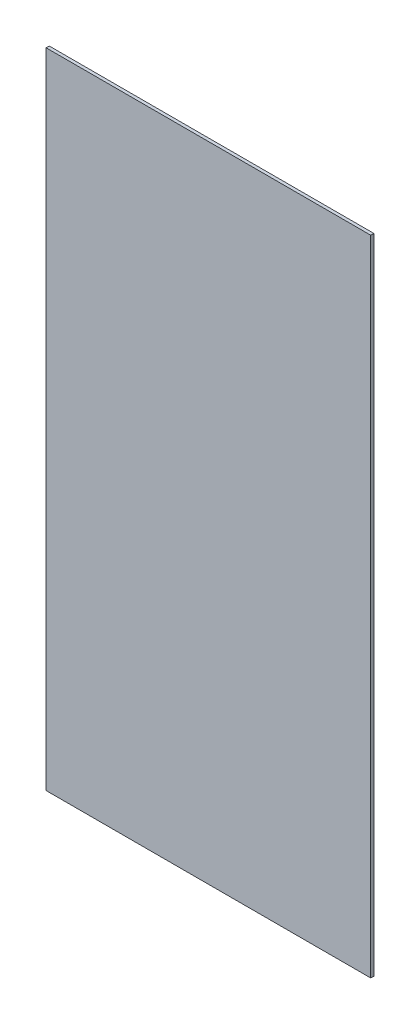
ISO-10303-21;
HEADER;
FILE_DESCRIPTION(('STEP AP214'),'2;1');
FILE_NAME('part.step','',(''),(''),'','','');
FILE_SCHEMA(('AUTOMOTIVE_DESIGN { 1 0 10303 214 1 1 1 1 }'));
ENDSEC;
DATA;
#1=APPLICATION_CONTEXT('core data for automotive mechanical design processes');
#2=APPLICATION_PROTOCOL_DEFINITION('international standard','automotive_design',2000,#1);
#3=PRODUCT_CONTEXT('',#1,'mechanical');
#4=PRODUCT('Part','Part','',(#3));
#5=PRODUCT_RELATED_PRODUCT_CATEGORY('part','',(#4));
#6=PRODUCT_DEFINITION_FORMATION('','',#4);
#7=PRODUCT_DEFINITION_CONTEXT('part definition',#1,'design');
#8=PRODUCT_DEFINITION('design','',#6,#7);
#9=PRODUCT_DEFINITION_SHAPE('','',#8);
#10=(LENGTH_UNIT() NAMED_UNIT(*) SI_UNIT(.MILLI.,.METRE.));
#11=(NAMED_UNIT(*) PLANE_ANGLE_UNIT() SI_UNIT($,.RADIAN.));
#12=(NAMED_UNIT(*) SI_UNIT($,.STERADIAN.) SOLID_ANGLE_UNIT());
#13=UNCERTAINTY_MEASURE_WITH_UNIT(LENGTH_MEASURE(1.E-05),#10,'distance_accuracy_value','');
#14=(GEOMETRIC_REPRESENTATION_CONTEXT(3) GLOBAL_UNCERTAINTY_ASSIGNED_CONTEXT((#13)) GLOBAL_UNIT_ASSIGNED_CONTEXT((#10,
#11,#12)) REPRESENTATION_CONTEXT('',''));
#15=CARTESIAN_POINT('',(0.,0.,0.));
#16=DIRECTION('',(0.,0.,1.));
#17=DIRECTION('',(1.,0.,0.));
#18=AXIS2_PLACEMENT_3D('',#15,#16,#17);
#19=CARTESIAN_POINT('',(-408.027306533152,376.861510791367,5.));
#20=DIRECTION('',(1.,0.,0.));
#21=DIRECTION('',(0.,0.,-1.));
#22=AXIS2_PLACEMENT_3D('',#19,#20,#21);
#23=PLANE('',#22);
#24=DIRECTION('',(0.,-1.,0.));
#25=VECTOR('',#24,1.);
#26=CARTESIAN_POINT('',(-408.027306533152,376.861510791367,0.));
#27=LINE('',#26,#25);
#28=CARTESIAN_POINT('',(-408.027306533152,376.861510791367,0.));
#29=VERTEX_POINT('',#28);
#30=CARTESIAN_POINT('',(-408.027306533152,-653.638489208633,0.));
#31=VERTEX_POINT('',#30);
#32=EDGE_CURVE('E107',#29,#31,#27,.T.);
#33=ORIENTED_EDGE('',*,*,#32,.T.);
#34=DIRECTION('',(0.,0.,-1.));
#35=VECTOR('',#34,1.);
#36=CARTESIAN_POINT('',(-408.027306533152,-653.638489208633,5.));
#37=LINE('',#36,#35);
#38=CARTESIAN_POINT('',(-408.027306533152,-653.638489208633,5.));
#39=VERTEX_POINT('',#38);
#40=EDGE_CURVE('E11',#39,#31,#37,.T.);
#41=ORIENTED_EDGE('',*,*,#40,.F.);
#42=DIRECTION('',(0.,-1.,0.));
#43=VECTOR('',#42,1.);
#44=CARTESIAN_POINT('',(-408.027306533152,376.861510791367,5.));
#45=LINE('',#44,#43);
#46=CARTESIAN_POINT('',(-408.027306533152,376.861510791367,5.));
#47=VERTEX_POINT('',#46);
#48=EDGE_CURVE('E91',#47,#39,#45,.T.);
#49=ORIENTED_EDGE('',*,*,#48,.F.);
#50=DIRECTION('',(0.,0.,-1.));
#51=VECTOR('',#50,1.);
#52=CARTESIAN_POINT('',(-408.027306533152,376.861510791367,5.));
#53=LINE('',#52,#51);
#54=EDGE_CURVE('E103',#47,#29,#53,.T.);
#55=ORIENTED_EDGE('',*,*,#54,.T.);
#56=EDGE_LOOP('',(#33,#41,#49,#55));
#57=FACE_BOUND('',#56,.T.);
#58=ADVANCED_FACE('F39',(#57),#23,.F.);
#59=CARTESIAN_POINT('',(-408.027306533152,-653.638489208633,5.));
#60=DIRECTION('',(0.,1.,0.));
#61=DIRECTION('',(-1.,0.,0.));
#62=AXIS2_PLACEMENT_3D('',#59,#60,#61);
#63=PLANE('',#62);
#64=DIRECTION('',(1.,0.,0.));
#65=VECTOR('',#64,1.);
#66=CARTESIAN_POINT('',(-408.027306533152,-653.638489208633,0.));
#67=LINE('',#66,#65);
#68=CARTESIAN_POINT('',(111.972693466848,-653.638489208633,0.));
#69=VERTEX_POINT('',#68);
#70=EDGE_CURVE('E96',#31,#69,#67,.T.);
#71=ORIENTED_EDGE('',*,*,#70,.T.);
#72=DIRECTION('',(0.,0.,-1.));
#73=VECTOR('',#72,1.);
#74=CARTESIAN_POINT('',(111.972693466848,-653.638489208633,5.));
#75=LINE('',#74,#73);
#76=CARTESIAN_POINT('',(111.972693466848,-653.638489208633,5.));
#77=VERTEX_POINT('',#76);
#78=EDGE_CURVE('E48',#77,#69,#75,.T.);
#79=ORIENTED_EDGE('',*,*,#78,.F.);
#80=DIRECTION('',(1.,0.,0.));
#81=VECTOR('',#80,1.);
#82=CARTESIAN_POINT('',(-408.027306533152,-653.638489208633,5.));
#83=LINE('',#82,#81);
#84=EDGE_CURVE('E86',#39,#77,#83,.T.);
#85=ORIENTED_EDGE('',*,*,#84,.F.);
#86=ORIENTED_EDGE('',*,*,#40,.T.);
#87=EDGE_LOOP('',(#71,#79,#85,#86));
#88=FACE_BOUND('',#87,.T.);
#89=ADVANCED_FACE('F95',(#88),#63,.F.);
#90=CARTESIAN_POINT('',(111.972693466848,376.861510791367,5.));
#91=DIRECTION('',(-1.,0.,0.));
#92=DIRECTION('',(0.,-1.,0.));
#93=AXIS2_PLACEMENT_3D('',#90,#91,#92);
#94=PLANE('',#93);
#95=DIRECTION('',(0.,1.,0.));
#96=VECTOR('',#95,1.);
#97=CARTESIAN_POINT('',(111.972693466848,376.861510791367,0.));
#98=LINE('',#97,#96);
#99=CARTESIAN_POINT('',(111.972693466848,376.861510791367,0.));
#100=VERTEX_POINT('',#99);
#101=EDGE_CURVE('E73',#69,#100,#98,.T.);
#102=ORIENTED_EDGE('',*,*,#101,.T.);
#103=DIRECTION('',(0.,0.,-1.));
#104=VECTOR('',#103,1.);
#105=CARTESIAN_POINT('',(111.972693466848,376.861510791367,5.));
#106=LINE('',#105,#104);
#107=CARTESIAN_POINT('',(111.972693466848,376.861510791367,5.));
#108=VERTEX_POINT('',#107);
#109=EDGE_CURVE('E98',#108,#100,#106,.T.);
#110=ORIENTED_EDGE('',*,*,#109,.F.);
#111=DIRECTION('',(0.,1.,0.));
#112=VECTOR('',#111,1.);
#113=CARTESIAN_POINT('',(111.972693466848,376.861510791367,5.));
#114=LINE('',#113,#112);
#115=EDGE_CURVE('E89',#77,#108,#114,.T.);
#116=ORIENTED_EDGE('',*,*,#115,.F.);
#117=ORIENTED_EDGE('',*,*,#78,.T.);
#118=EDGE_LOOP('',(#102,#110,#116,#117));
#119=FACE_BOUND('',#118,.T.);
#120=ADVANCED_FACE('F99',(#119),#94,.F.);
#121=CARTESIAN_POINT('',(-408.027306533152,376.861510791367,5.));
#122=DIRECTION('',(0.,-1.,0.));
#123=DIRECTION('',(0.,0.,-1.));
#124=AXIS2_PLACEMENT_3D('',#121,#122,#123);
#125=PLANE('',#124);
#126=DIRECTION('',(-1.,0.,0.));
#127=VECTOR('',#126,1.);
#128=CARTESIAN_POINT('',(-408.027306533152,376.861510791367,0.));
#129=LINE('',#128,#127);
#130=EDGE_CURVE('E79',#100,#29,#129,.T.);
#131=ORIENTED_EDGE('',*,*,#130,.T.);
#132=ORIENTED_EDGE('',*,*,#54,.F.);
#133=DIRECTION('',(-1.,0.,0.));
#134=VECTOR('',#133,1.);
#135=CARTESIAN_POINT('',(-408.027306533152,376.861510791367,5.));
#136=LINE('',#135,#134);
#137=EDGE_CURVE('E56',#108,#47,#136,.T.);
#138=ORIENTED_EDGE('',*,*,#137,.F.);
#139=ORIENTED_EDGE('',*,*,#109,.T.);
#140=EDGE_LOOP('',(#131,#132,#138,#139));
#141=FACE_BOUND('',#140,.T.);
#142=ADVANCED_FACE('F120',(#141),#125,.F.);
#143=CARTESIAN_POINT('',(0.,0.,5.));
#144=DIRECTION('',(0.,0.,1.));
#145=DIRECTION('',(1.,0.,0.));
#146=AXIS2_PLACEMENT_3D('',#143,#144,#145);
#147=PLANE('',#146);
#148=ORIENTED_EDGE('',*,*,#48,.T.);
#149=ORIENTED_EDGE('',*,*,#84,.T.);
#150=ORIENTED_EDGE('',*,*,#115,.T.);
#151=ORIENTED_EDGE('',*,*,#137,.T.);
#152=EDGE_LOOP('',(#148,#149,#150,#151));
#153=FACE_BOUND('',#152,.T.);
#154=ADVANCED_FACE('F87',(#153),#147,.T.);
#155=CARTESIAN_POINT('',(0.,0.,0.));
#156=DIRECTION('',(0.,0.,1.));
#157=DIRECTION('',(1.,0.,0.));
#158=AXIS2_PLACEMENT_3D('',#155,#156,#157);
#159=PLANE('',#158);
#160=ORIENTED_EDGE('',*,*,#32,.F.);
#161=ORIENTED_EDGE('',*,*,#130,.F.);
#162=ORIENTED_EDGE('',*,*,#101,.F.);
#163=ORIENTED_EDGE('',*,*,#70,.F.);
#164=EDGE_LOOP('',(#160,#161,#162,#163));
#165=FACE_BOUND('',#164,.T.);
#166=ADVANCED_FACE('F123',(#165),#159,.F.);
#167=CLOSED_SHELL('',(#58,#89,#120,#142,#154,#166));
#168=MANIFOLD_SOLID_BREP('B2',#167);
#169=ADVANCED_BREP_SHAPE_REPRESENTATION('',(#18,#168),#14);
#170=SHAPE_DEFINITION_REPRESENTATION(#9,#169);
ENDSEC;
END-ISO-10303-21;
